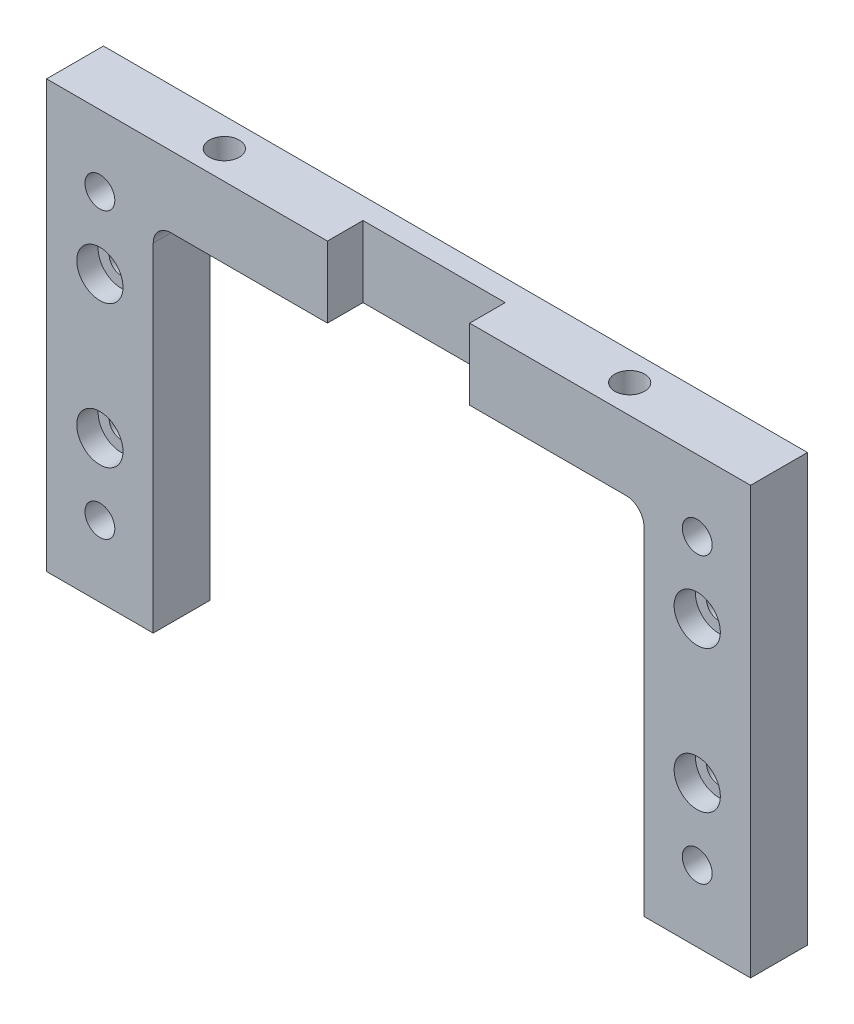
ISO-10303-21;
HEADER;
FILE_DESCRIPTION(('STEP AP214'),'2;1');
FILE_NAME('part.step','',(''),(''),'','','');
FILE_SCHEMA(('AUTOMOTIVE_DESIGN { 1 0 10303 214 1 1 1 1 }'));
ENDSEC;
DATA;
#1=APPLICATION_CONTEXT('core data for automotive mechanical design processes');
#2=APPLICATION_PROTOCOL_DEFINITION('international standard','automotive_design',2000,#1);
#3=PRODUCT_CONTEXT('',#1,'mechanical');
#4=PRODUCT('Part','Part','',(#3));
#5=PRODUCT_RELATED_PRODUCT_CATEGORY('part','',(#4));
#6=PRODUCT_DEFINITION_FORMATION('','',#4);
#7=PRODUCT_DEFINITION_CONTEXT('part definition',#1,'design');
#8=PRODUCT_DEFINITION('design','',#6,#7);
#9=PRODUCT_DEFINITION_SHAPE('','',#8);
#10=(LENGTH_UNIT() NAMED_UNIT(*) SI_UNIT(.MILLI.,.METRE.));
#11=(NAMED_UNIT(*) PLANE_ANGLE_UNIT() SI_UNIT($,.RADIAN.));
#12=(NAMED_UNIT(*) SI_UNIT($,.STERADIAN.) SOLID_ANGLE_UNIT());
#13=UNCERTAINTY_MEASURE_WITH_UNIT(LENGTH_MEASURE(1.E-05),#10,'distance_accuracy_value','');
#14=(GEOMETRIC_REPRESENTATION_CONTEXT(3) GLOBAL_UNCERTAINTY_ASSIGNED_CONTEXT((#13)) GLOBAL_UNIT_ASSIGNED_CONTEXT((#10,
#11,#12)) REPRESENTATION_CONTEXT('',''));
#15=CARTESIAN_POINT('',(0.,0.,0.));
#16=DIRECTION('',(0.,0.,1.));
#17=DIRECTION('',(1.,0.,0.));
#18=AXIS2_PLACEMENT_3D('',#15,#16,#17);
#19=CARTESIAN_POINT('',(32.,47.5,4.));
#20=DIRECTION('',(0.,0.,1.));
#21=DIRECTION('',(1.,0.,0.));
#22=AXIS2_PLACEMENT_3D('',#19,#20,#21);
#23=PLANE('',#22);
#24=DIRECTION('',(0.,-1.,0.));
#25=VECTOR('',#24,1.);
#26=CARTESIAN_POINT('',(-10.,50.,4.));
#27=LINE('',#26,#25);
#28=CARTESIAN_POINT('',(-10.,60.,4.));
#29=VERTEX_POINT('',#28);
#30=CARTESIAN_POINT('',(-10.,50.,4.));
#31=VERTEX_POINT('',#30);
#32=EDGE_CURVE('E141',#29,#31,#27,.T.);
#33=ORIENTED_EDGE('',*,*,#32,.F.);
#34=DIRECTION('',(-1.,0.,0.));
#35=VECTOR('',#34,1.);
#36=CARTESIAN_POINT('',(-49.5,60.,4.));
#37=LINE('',#36,#35);
#38=CARTESIAN_POINT('',(-49.5,60.,4.));
#39=VERTEX_POINT('',#38);
#40=EDGE_CURVE('E133',#29,#39,#37,.T.);
#41=ORIENTED_EDGE('',*,*,#40,.T.);
#42=DIRECTION('',(0.,-1.,0.));
#43=VECTOR('',#42,1.);
#44=CARTESIAN_POINT('',(-49.5,0.,4.));
#45=LINE('',#44,#43);
#46=CARTESIAN_POINT('',(-49.5,0.,4.));
#47=VERTEX_POINT('',#46);
#48=EDGE_CURVE('E137',#39,#47,#45,.T.);
#49=ORIENTED_EDGE('',*,*,#48,.T.);
#50=DIRECTION('',(1.,0.,0.));
#51=VECTOR('',#50,1.);
#52=CARTESIAN_POINT('',(-34.5,0.,4.));
#53=LINE('',#52,#51);
#54=CARTESIAN_POINT('',(-34.5,0.,4.));
#55=VERTEX_POINT('',#54);
#56=EDGE_CURVE('E63',#47,#55,#53,.T.);
#57=ORIENTED_EDGE('',*,*,#56,.T.);
#58=DIRECTION('',(0.,1.,0.));
#59=VECTOR('',#58,1.);
#60=CARTESIAN_POINT('',(-34.5,47.5,4.));
#61=LINE('',#60,#59);
#62=CARTESIAN_POINT('',(-34.5,47.5,4.));
#63=VERTEX_POINT('',#62);
#64=EDGE_CURVE('E186',#55,#63,#61,.T.);
#65=ORIENTED_EDGE('',*,*,#64,.T.);
#66=CARTESIAN_POINT('',(-32.,47.5,4.));
#67=DIRECTION('',(0.,0.,-1.));
#68=DIRECTION('',(1.,0.,0.));
#69=AXIS2_PLACEMENT_3D('',#66,#67,#68);
#70=CIRCLE('',#69,2.5);
#71=CARTESIAN_POINT('',(-32.,50.,4.));
#72=VERTEX_POINT('',#71);
#73=EDGE_CURVE('E110',#63,#72,#70,.T.);
#74=ORIENTED_EDGE('',*,*,#73,.T.);
#75=DIRECTION('',(1.,0.,0.));
#76=VECTOR('',#75,1.);
#77=CARTESIAN_POINT('',(32.,50.,4.));
#78=LINE('',#77,#76);
#79=EDGE_CURVE('E209',#72,#31,#78,.T.);
#80=ORIENTED_EDGE('',*,*,#79,.T.);
#81=EDGE_LOOP('',(#33,#41,#49,#57,#65,#74,#80));
#82=FACE_BOUND('',#81,.T.);
#83=CARTESIAN_POINT('',(-42.,20.,4.));
#84=DIRECTION('',(0.,0.,1.));
#85=DIRECTION('',(1.,0.,0.));
#86=AXIS2_PLACEMENT_3D('',#83,#84,#85);
#87=CIRCLE('',#86,3.25);
#88=CARTESIAN_POINT('',(-38.75,20.,4.));
#89=VERTEX_POINT('',#88);
#90=EDGE_CURVE('E333',#89,#89,#87,.T.);
#91=ORIENTED_EDGE('',*,*,#90,.F.);
#92=EDGE_LOOP('',(#91));
#93=FACE_BOUND('',#92,.T.);
#94=CARTESIAN_POINT('',(-42.,40.,4.));
#95=DIRECTION('',(0.,0.,1.));
#96=DIRECTION('',(1.,0.,0.));
#97=AXIS2_PLACEMENT_3D('',#94,#95,#96);
#98=CIRCLE('',#97,3.25);
#99=CARTESIAN_POINT('',(-38.75,40.,4.));
#100=VERTEX_POINT('',#99);
#101=EDGE_CURVE('E321',#100,#100,#98,.T.);
#102=ORIENTED_EDGE('',*,*,#101,.F.);
#103=EDGE_LOOP('',(#102));
#104=FACE_BOUND('',#103,.T.);
#105=CARTESIAN_POINT('',(-42.,50.,4.));
#106=DIRECTION('',(0.,0.,1.));
#107=DIRECTION('',(1.,0.,0.));
#108=AXIS2_PLACEMENT_3D('',#105,#106,#107);
#109=CIRCLE('',#108,2.1);
#110=CARTESIAN_POINT('',(-39.9,50.,4.));
#111=VERTEX_POINT('',#110);
#112=EDGE_CURVE('E315',#111,#111,#109,.T.);
#113=ORIENTED_EDGE('',*,*,#112,.F.);
#114=EDGE_LOOP('',(#113));
#115=FACE_BOUND('',#114,.T.);
#116=CARTESIAN_POINT('',(-42.,10.,4.));
#117=DIRECTION('',(0.,0.,1.));
#118=DIRECTION('',(1.,0.,0.));
#119=AXIS2_PLACEMENT_3D('',#116,#117,#118);
#120=CIRCLE('',#119,2.1);
#121=CARTESIAN_POINT('',(-39.9,10.,4.));
#122=VERTEX_POINT('',#121);
#123=EDGE_CURVE('E309',#122,#122,#120,.T.);
#124=ORIENTED_EDGE('',*,*,#123,.F.);
#125=EDGE_LOOP('',(#124));
#126=FACE_BOUND('',#125,.T.);
#127=ADVANCED_FACE('F39',(#82,#93,#104,#115,#126),#23,.T.);
#128=CARTESIAN_POINT('',(-49.5,60.,4.));
#129=DIRECTION('',(0.,-1.,0.));
#130=DIRECTION('',(0.,0.,-1.));
#131=AXIS2_PLACEMENT_3D('',#128,#129,#130);
#132=PLANE('',#131);
#133=ORIENTED_EDGE('',*,*,#40,.F.);
#134=DIRECTION('',(0.,0.,1.));
#135=VECTOR('',#134,1.);
#136=CARTESIAN_POINT('',(-10.,60.,-1.));
#137=LINE('',#136,#135);
#138=CARTESIAN_POINT('',(-10.,60.,-1.));
#139=VERTEX_POINT('',#138);
#140=EDGE_CURVE('E252',#139,#29,#137,.T.);
#141=ORIENTED_EDGE('',*,*,#140,.F.);
#142=DIRECTION('',(-1.,0.,0.));
#143=VECTOR('',#142,1.);
#144=CARTESIAN_POINT('',(-10.,60.,-1.));
#145=LINE('',#144,#143);
#146=CARTESIAN_POINT('',(10.,60.,-1.));
#147=VERTEX_POINT('',#146);
#148=EDGE_CURVE('E249',#147,#139,#145,.T.);
#149=ORIENTED_EDGE('',*,*,#148,.F.);
#150=DIRECTION('',(0.,0.,1.));
#151=VECTOR('',#150,1.);
#152=CARTESIAN_POINT('',(10.,60.,-1.));
#153=LINE('',#152,#151);
#154=CARTESIAN_POINT('',(10.,60.,4.));
#155=VERTEX_POINT('',#154);
#156=EDGE_CURVE('E246',#147,#155,#153,.T.);
#157=ORIENTED_EDGE('',*,*,#156,.T.);
#158=CARTESIAN_POINT('',(49.5,60.,4.));
#159=VERTEX_POINT('',#158);
#160=EDGE_CURVE('E144',#159,#155,#37,.T.);
#161=ORIENTED_EDGE('',*,*,#160,.F.);
#162=DIRECTION('',(0.,0.,-1.));
#163=VECTOR('',#162,1.);
#164=CARTESIAN_POINT('',(49.5,60.,4.));
#165=LINE('',#164,#163);
#166=CARTESIAN_POINT('',(49.5,60.,-4.));
#167=VERTEX_POINT('',#166);
#168=EDGE_CURVE('E156',#159,#167,#165,.T.);
#169=ORIENTED_EDGE('',*,*,#168,.T.);
#170=DIRECTION('',(-1.,0.,0.));
#171=VECTOR('',#170,1.);
#172=CARTESIAN_POINT('',(-49.5,60.,-4.));
#173=LINE('',#172,#171);
#174=CARTESIAN_POINT('',(-49.5,60.,-4.));
#175=VERTEX_POINT('',#174);
#176=EDGE_CURVE('E153',#167,#175,#173,.T.);
#177=ORIENTED_EDGE('',*,*,#176,.T.);
#178=DIRECTION('',(0.,0.,-1.));
#179=VECTOR('',#178,1.);
#180=CARTESIAN_POINT('',(-49.5,60.,4.));
#181=LINE('',#180,#179);
#182=EDGE_CURVE('E148',#39,#175,#181,.T.);
#183=ORIENTED_EDGE('',*,*,#182,.F.);
#184=EDGE_LOOP('',(#133,#141,#149,#157,#161,#169,#177,#183));
#185=FACE_BOUND('',#184,.T.);
#186=CARTESIAN_POINT('',(-28.5,60.,0.));
#187=DIRECTION('',(0.,1.,0.));
#188=DIRECTION('',(0.,0.,1.));
#189=AXIS2_PLACEMENT_3D('',#186,#187,#188);
#190=CIRCLE('',#189,2.09999999999999);
#191=CARTESIAN_POINT('',(-28.5,60.,2.09999999999999));
#192=VERTEX_POINT('',#191);
#193=EDGE_CURVE('E303',#192,#192,#190,.T.);
#194=ORIENTED_EDGE('',*,*,#193,.F.);
#195=EDGE_LOOP('',(#194));
#196=FACE_BOUND('',#195,.T.);
#197=CARTESIAN_POINT('',(28.5,60.,0.));
#198=DIRECTION('',(0.,1.,0.));
#199=DIRECTION('',(0.,0.,1.));
#200=AXIS2_PLACEMENT_3D('',#197,#198,#199);
#201=CIRCLE('',#200,2.09999999999999);
#202=CARTESIAN_POINT('',(28.5,60.,2.09999999999999));
#203=VERTEX_POINT('',#202);
#204=EDGE_CURVE('E255',#203,#203,#201,.T.);
#205=ORIENTED_EDGE('',*,*,#204,.F.);
#206=EDGE_LOOP('',(#205));
#207=FACE_BOUND('',#206,.T.);
#208=ADVANCED_FACE('F149',(#185,#196,#207),#132,.F.);
#209=CARTESIAN_POINT('',(-34.5,47.5,4.));
#210=DIRECTION('',(-1.,0.,0.));
#211=DIRECTION('',(0.,-1.,0.));
#212=AXIS2_PLACEMENT_3D('',#209,#210,#211);
#213=PLANE('',#212);
#214=DIRECTION('',(0.,1.,0.));
#215=VECTOR('',#214,1.);
#216=CARTESIAN_POINT('',(-34.5,47.5,-4.));
#217=LINE('',#216,#215);
#218=CARTESIAN_POINT('',(-34.5,0.,-4.));
#219=VERTEX_POINT('',#218);
#220=CARTESIAN_POINT('',(-34.5,47.5,-4.));
#221=VERTEX_POINT('',#220);
#222=EDGE_CURVE('E166',#219,#221,#217,.T.);
#223=ORIENTED_EDGE('',*,*,#222,.T.);
#224=DIRECTION('',(0.,0.,-1.));
#225=VECTOR('',#224,1.);
#226=CARTESIAN_POINT('',(-34.5,47.5,4.));
#227=LINE('',#226,#225);
#228=EDGE_CURVE('E11',#63,#221,#227,.T.);
#229=ORIENTED_EDGE('',*,*,#228,.F.);
#230=ORIENTED_EDGE('',*,*,#64,.F.);
#231=DIRECTION('',(0.,0.,-1.));
#232=VECTOR('',#231,1.);
#233=CARTESIAN_POINT('',(-34.5,0.,4.));
#234=LINE('',#233,#232);
#235=EDGE_CURVE('E161',#55,#219,#234,.T.);
#236=ORIENTED_EDGE('',*,*,#235,.T.);
#237=EDGE_LOOP('',(#223,#229,#230,#236));
#238=FACE_BOUND('',#237,.T.);
#239=ADVANCED_FACE('F41',(#238),#213,.F.);
#240=CARTESIAN_POINT('',(-32.,47.5,4.));
#241=DIRECTION('',(0.,0.,-1.));
#242=DIRECTION('',(-1.,0.,0.));
#243=AXIS2_PLACEMENT_3D('',#240,#241,#242);
#244=CYLINDRICAL_SURFACE('',#243,2.5);
#245=CARTESIAN_POINT('',(-32.,47.5,-4.));
#246=DIRECTION('',(0.,0.,-1.));
#247=DIRECTION('',(1.,0.,0.));
#248=AXIS2_PLACEMENT_3D('',#245,#246,#247);
#249=CIRCLE('',#248,2.5);
#250=CARTESIAN_POINT('',(-32.,50.,-4.));
#251=VERTEX_POINT('',#250);
#252=EDGE_CURVE('E169',#221,#251,#249,.T.);
#253=ORIENTED_EDGE('',*,*,#252,.T.);
#254=DIRECTION('',(0.,0.,-1.));
#255=VECTOR('',#254,1.);
#256=CARTESIAN_POINT('',(-32.,50.,4.));
#257=LINE('',#256,#255);
#258=EDGE_CURVE('E47',#72,#251,#257,.T.);
#259=ORIENTED_EDGE('',*,*,#258,.F.);
#260=ORIENTED_EDGE('',*,*,#73,.F.);
#261=ORIENTED_EDGE('',*,*,#228,.T.);
#262=EDGE_LOOP('',(#253,#259,#260,#261));
#263=FACE_BOUND('',#262,.T.);
#264=ADVANCED_FACE('F411',(#263),#244,.F.);
#265=CARTESIAN_POINT('',(32.,50.,4.));
#266=DIRECTION('',(0.,1.,0.));
#267=DIRECTION('',(0.,0.,1.));
#268=AXIS2_PLACEMENT_3D('',#265,#266,#267);
#269=PLANE('',#268);
#270=CARTESIAN_POINT('',(28.5,50.,0.));
#271=DIRECTION('',(0.,1.,0.));
#272=DIRECTION('',(0.,0.,1.));
#273=AXIS2_PLACEMENT_3D('',#270,#271,#272);
#274=CIRCLE('',#273,2.09999999999999);
#275=CARTESIAN_POINT('',(28.5,50.,2.09999999999999));
#276=VERTEX_POINT('',#275);
#277=EDGE_CURVE('E264',#276,#276,#274,.T.);
#278=ORIENTED_EDGE('',*,*,#277,.T.);
#279=EDGE_LOOP('',(#278));
#280=FACE_BOUND('',#279,.T.);
#281=CARTESIAN_POINT('',(-28.5,50.,0.));
#282=DIRECTION('',(0.,1.,0.));
#283=DIRECTION('',(0.,0.,1.));
#284=AXIS2_PLACEMENT_3D('',#281,#282,#283);
#285=CIRCLE('',#284,2.09999999999999);
#286=CARTESIAN_POINT('',(-28.5,50.,2.09999999999999));
#287=VERTEX_POINT('',#286);
#288=EDGE_CURVE('E306',#287,#287,#285,.T.);
#289=ORIENTED_EDGE('',*,*,#288,.T.);
#290=EDGE_LOOP('',(#289));
#291=FACE_BOUND('',#290,.T.);
#292=DIRECTION('',(1.,0.,0.));
#293=VECTOR('',#292,1.);
#294=CARTESIAN_POINT('',(-10.,50.,-1.));
#295=LINE('',#294,#293);
#296=CARTESIAN_POINT('',(-10.,50.,-1.));
#297=VERTEX_POINT('',#296);
#298=CARTESIAN_POINT('',(10.,50.,-1.));
#299=VERTEX_POINT('',#298);
#300=EDGE_CURVE('E351',#297,#299,#295,.T.);
#301=ORIENTED_EDGE('',*,*,#300,.F.);
#302=DIRECTION('',(0.,0.,1.));
#303=VECTOR('',#302,1.);
#304=CARTESIAN_POINT('',(-10.,50.,-1.));
#305=LINE('',#304,#303);
#306=EDGE_CURVE('E257',#297,#31,#305,.T.);
#307=ORIENTED_EDGE('',*,*,#306,.T.);
#308=ORIENTED_EDGE('',*,*,#79,.F.);
#309=ORIENTED_EDGE('',*,*,#258,.T.);
#310=DIRECTION('',(1.,0.,0.));
#311=VECTOR('',#310,1.);
#312=CARTESIAN_POINT('',(32.,50.,-4.));
#313=LINE('',#312,#311);
#314=CARTESIAN_POINT('',(32.,50.,-4.));
#315=VERTEX_POINT('',#314);
#316=EDGE_CURVE('E172',#251,#315,#313,.T.);
#317=ORIENTED_EDGE('',*,*,#316,.T.);
#318=DIRECTION('',(0.,0.,-1.));
#319=VECTOR('',#318,1.);
#320=CARTESIAN_POINT('',(32.,50.,4.));
#321=LINE('',#320,#319);
#322=CARTESIAN_POINT('',(32.,50.,4.));
#323=VERTEX_POINT('',#322);
#324=EDGE_CURVE('E199',#323,#315,#321,.T.);
#325=ORIENTED_EDGE('',*,*,#324,.F.);
#326=CARTESIAN_POINT('',(10.,50.,4.));
#327=VERTEX_POINT('',#326);
#328=EDGE_CURVE('E345',#327,#323,#78,.T.);
#329=ORIENTED_EDGE('',*,*,#328,.F.);
#330=DIRECTION('',(0.,0.,1.));
#331=VECTOR('',#330,1.);
#332=CARTESIAN_POINT('',(10.,50.,-1.));
#333=LINE('',#332,#331);
#334=EDGE_CURVE('E54',#299,#327,#333,.T.);
#335=ORIENTED_EDGE('',*,*,#334,.F.);
#336=EDGE_LOOP('',(#301,#307,#308,#309,#317,#325,#329,#335));
#337=FACE_BOUND('',#336,.T.);
#338=ADVANCED_FACE('F206',(#280,#291,#337),#269,.F.);
#339=CARTESIAN_POINT('',(32.,47.5,4.));
#340=DIRECTION('',(0.,0.,-1.));
#341=DIRECTION('',(-1.,0.,0.));
#342=AXIS2_PLACEMENT_3D('',#339,#340,#341);
#343=CYLINDRICAL_SURFACE('',#342,2.5);
#344=CARTESIAN_POINT('',(32.,47.5,-4.));
#345=DIRECTION('',(0.,0.,-1.));
#346=DIRECTION('',(1.,0.,0.));
#347=AXIS2_PLACEMENT_3D('',#344,#345,#346);
#348=CIRCLE('',#347,2.5);
#349=CARTESIAN_POINT('',(34.5,47.5,-4.));
#350=VERTEX_POINT('',#349);
#351=EDGE_CURVE('E174',#315,#350,#348,.T.);
#352=ORIENTED_EDGE('',*,*,#351,.T.);
#353=DIRECTION('',(0.,0.,-1.));
#354=VECTOR('',#353,1.);
#355=CARTESIAN_POINT('',(34.5,47.5,4.));
#356=LINE('',#355,#354);
#357=CARTESIAN_POINT('',(34.5,47.5,4.));
#358=VERTEX_POINT('',#357);
#359=EDGE_CURVE('E196',#358,#350,#356,.T.);
#360=ORIENTED_EDGE('',*,*,#359,.F.);
#361=CARTESIAN_POINT('',(32.,47.5,4.));
#362=DIRECTION('',(0.,0.,-1.));
#363=DIRECTION('',(1.,0.,0.));
#364=AXIS2_PLACEMENT_3D('',#361,#362,#363);
#365=CIRCLE('',#364,2.5);
#366=EDGE_CURVE('E228',#323,#358,#365,.T.);
#367=ORIENTED_EDGE('',*,*,#366,.F.);
#368=ORIENTED_EDGE('',*,*,#324,.T.);
#369=EDGE_LOOP('',(#352,#360,#367,#368));
#370=FACE_BOUND('',#369,.T.);
#371=ADVANCED_FACE('F218',(#370),#343,.F.);
#372=CARTESIAN_POINT('',(34.5,0.,4.));
#373=DIRECTION('',(1.,0.,0.));
#374=DIRECTION('',(0.,1.,0.));
#375=AXIS2_PLACEMENT_3D('',#372,#373,#374);
#376=PLANE('',#375);
#377=DIRECTION('',(0.,-1.,0.));
#378=VECTOR('',#377,1.);
#379=CARTESIAN_POINT('',(34.5,0.,-4.));
#380=LINE('',#379,#378);
#381=CARTESIAN_POINT('',(34.5,0.,-4.));
#382=VERTEX_POINT('',#381);
#383=EDGE_CURVE('E176',#350,#382,#380,.T.);
#384=ORIENTED_EDGE('',*,*,#383,.T.);
#385=DIRECTION('',(0.,0.,-1.));
#386=VECTOR('',#385,1.);
#387=CARTESIAN_POINT('',(34.5,0.,4.));
#388=LINE('',#387,#386);
#389=CARTESIAN_POINT('',(34.5,0.,4.));
#390=VERTEX_POINT('',#389);
#391=EDGE_CURVE('E193',#390,#382,#388,.T.);
#392=ORIENTED_EDGE('',*,*,#391,.F.);
#393=DIRECTION('',(0.,-1.,0.));
#394=VECTOR('',#393,1.);
#395=CARTESIAN_POINT('',(34.5,0.,4.));
#396=LINE('',#395,#394);
#397=EDGE_CURVE('E224',#358,#390,#396,.T.);
#398=ORIENTED_EDGE('',*,*,#397,.F.);
#399=ORIENTED_EDGE('',*,*,#359,.T.);
#400=EDGE_LOOP('',(#384,#392,#398,#399));
#401=FACE_BOUND('',#400,.T.);
#402=ADVANCED_FACE('F222',(#401),#376,.F.);
#403=CARTESIAN_POINT('',(49.5,0.,4.));
#404=DIRECTION('',(0.,1.,0.));
#405=DIRECTION('',(-1.,0.,0.));
#406=AXIS2_PLACEMENT_3D('',#403,#404,#405);
#407=PLANE('',#406);
#408=DIRECTION('',(1.,0.,0.));
#409=VECTOR('',#408,1.);
#410=CARTESIAN_POINT('',(49.5,0.,-4.));
#411=LINE('',#410,#409);
#412=CARTESIAN_POINT('',(49.5,0.,-4.));
#413=VERTEX_POINT('',#412);
#414=EDGE_CURVE('E178',#382,#413,#411,.T.);
#415=ORIENTED_EDGE('',*,*,#414,.T.);
#416=DIRECTION('',(0.,0.,-1.));
#417=VECTOR('',#416,1.);
#418=CARTESIAN_POINT('',(49.5,0.,4.));
#419=LINE('',#418,#417);
#420=CARTESIAN_POINT('',(49.5,0.,4.));
#421=VERTEX_POINT('',#420);
#422=EDGE_CURVE('E190',#421,#413,#419,.T.);
#423=ORIENTED_EDGE('',*,*,#422,.F.);
#424=DIRECTION('',(1.,0.,0.));
#425=VECTOR('',#424,1.);
#426=CARTESIAN_POINT('',(49.5,0.,4.));
#427=LINE('',#426,#425);
#428=EDGE_CURVE('E227',#390,#421,#427,.T.);
#429=ORIENTED_EDGE('',*,*,#428,.F.);
#430=ORIENTED_EDGE('',*,*,#391,.T.);
#431=EDGE_LOOP('',(#415,#423,#429,#430));
#432=FACE_BOUND('',#431,.T.);
#433=ADVANCED_FACE('F402',(#432),#407,.F.);
#434=CARTESIAN_POINT('',(49.5,60.,4.));
#435=DIRECTION('',(-1.,0.,0.));
#436=DIRECTION('',(0.,0.,1.));
#437=AXIS2_PLACEMENT_3D('',#434,#435,#436);
#438=PLANE('',#437);
#439=DIRECTION('',(0.,1.,0.));
#440=VECTOR('',#439,1.);
#441=CARTESIAN_POINT('',(49.5,60.,-4.));
#442=LINE('',#441,#440);
#443=EDGE_CURVE('E180',#413,#167,#442,.T.);
#444=ORIENTED_EDGE('',*,*,#443,.T.);
#445=ORIENTED_EDGE('',*,*,#168,.F.);
#446=DIRECTION('',(0.,1.,0.));
#447=VECTOR('',#446,1.);
#448=CARTESIAN_POINT('',(49.5,60.,4.));
#449=LINE('',#448,#447);
#450=EDGE_CURVE('E145',#421,#159,#449,.T.);
#451=ORIENTED_EDGE('',*,*,#450,.F.);
#452=ORIENTED_EDGE('',*,*,#422,.T.);
#453=EDGE_LOOP('',(#444,#445,#451,#452));
#454=FACE_BOUND('',#453,.T.);
#455=ADVANCED_FACE('F241',(#454),#438,.F.);
#456=CARTESIAN_POINT('',(-49.5,0.,4.));
#457=DIRECTION('',(1.,0.,0.));
#458=DIRECTION('',(0.,0.,-1.));
#459=AXIS2_PLACEMENT_3D('',#456,#457,#458);
#460=PLANE('',#459);
#461=DIRECTION('',(0.,-1.,0.));
#462=VECTOR('',#461,1.);
#463=CARTESIAN_POINT('',(-49.5,0.,-4.));
#464=LINE('',#463,#462);
#465=CARTESIAN_POINT('',(-49.5,0.,-4.));
#466=VERTEX_POINT('',#465);
#467=EDGE_CURVE('E183',#175,#466,#464,.T.);
#468=ORIENTED_EDGE('',*,*,#467,.T.);
#469=DIRECTION('',(0.,0.,-1.));
#470=VECTOR('',#469,1.);
#471=CARTESIAN_POINT('',(-49.5,0.,4.));
#472=LINE('',#471,#470);
#473=EDGE_CURVE('E157',#47,#466,#472,.T.);
#474=ORIENTED_EDGE('',*,*,#473,.F.);
#475=ORIENTED_EDGE('',*,*,#48,.F.);
#476=ORIENTED_EDGE('',*,*,#182,.T.);
#477=EDGE_LOOP('',(#468,#474,#475,#476));
#478=FACE_BOUND('',#477,.T.);
#479=ADVANCED_FACE('F159',(#478),#460,.F.);
#480=CARTESIAN_POINT('',(-34.5,0.,4.));
#481=DIRECTION('',(0.,1.,0.));
#482=DIRECTION('',(-1.,0.,0.));
#483=AXIS2_PLACEMENT_3D('',#480,#481,#482);
#484=PLANE('',#483);
#485=DIRECTION('',(1.,0.,0.));
#486=VECTOR('',#485,1.);
#487=CARTESIAN_POINT('',(-34.5,0.,-4.));
#488=LINE('',#487,#486);
#489=EDGE_CURVE('E102',#466,#219,#488,.T.);
#490=ORIENTED_EDGE('',*,*,#489,.T.);
#491=ORIENTED_EDGE('',*,*,#235,.F.);
#492=ORIENTED_EDGE('',*,*,#56,.F.);
#493=ORIENTED_EDGE('',*,*,#473,.T.);
#494=EDGE_LOOP('',(#490,#491,#492,#493));
#495=FACE_BOUND('',#494,.T.);
#496=ADVANCED_FACE('F387',(#495),#484,.F.);
#497=DIRECTION('',(0.,1.,0.));
#498=VECTOR('',#497,1.);
#499=CARTESIAN_POINT('',(10.,50.,4.));
#500=LINE('',#499,#498);
#501=EDGE_CURVE('E347',#327,#155,#500,.T.);
#502=ORIENTED_EDGE('',*,*,#501,.F.);
#503=ORIENTED_EDGE('',*,*,#328,.T.);
#504=ORIENTED_EDGE('',*,*,#366,.T.);
#505=ORIENTED_EDGE('',*,*,#397,.T.);
#506=ORIENTED_EDGE('',*,*,#428,.T.);
#507=ORIENTED_EDGE('',*,*,#450,.T.);
#508=ORIENTED_EDGE('',*,*,#160,.T.);
#509=EDGE_LOOP('',(#502,#503,#504,#505,#506,#507,#508));
#510=FACE_BOUND('',#509,.T.);
#511=CARTESIAN_POINT('',(42.,10.,4.));
#512=DIRECTION('',(0.,0.,1.));
#513=DIRECTION('',(1.,0.,0.));
#514=AXIS2_PLACEMENT_3D('',#511,#512,#513);
#515=CIRCLE('',#514,2.1);
#516=CARTESIAN_POINT('',(44.1,10.,4.));
#517=VERTEX_POINT('',#516);
#518=EDGE_CURVE('E267',#517,#517,#515,.T.);
#519=ORIENTED_EDGE('',*,*,#518,.F.);
#520=EDGE_LOOP('',(#519));
#521=FACE_BOUND('',#520,.T.);
#522=CARTESIAN_POINT('',(42.,50.,4.));
#523=DIRECTION('',(0.,0.,1.));
#524=DIRECTION('',(1.,0.,0.));
#525=AXIS2_PLACEMENT_3D('',#522,#523,#524);
#526=CIRCLE('',#525,2.1);
#527=CARTESIAN_POINT('',(44.1,50.,4.));
#528=VERTEX_POINT('',#527);
#529=EDGE_CURVE('E273',#528,#528,#526,.T.);
#530=ORIENTED_EDGE('',*,*,#529,.F.);
#531=EDGE_LOOP('',(#530));
#532=FACE_BOUND('',#531,.T.);
#533=CARTESIAN_POINT('',(42.,40.,4.));
#534=DIRECTION('',(0.,0.,1.));
#535=DIRECTION('',(1.,0.,0.));
#536=AXIS2_PLACEMENT_3D('',#533,#534,#535);
#537=CIRCLE('',#536,3.25);
#538=CARTESIAN_POINT('',(45.25,40.,4.));
#539=VERTEX_POINT('',#538);
#540=EDGE_CURVE('E279',#539,#539,#537,.T.);
#541=ORIENTED_EDGE('',*,*,#540,.F.);
#542=EDGE_LOOP('',(#541));
#543=FACE_BOUND('',#542,.T.);
#544=CARTESIAN_POINT('',(42.,20.,4.));
#545=DIRECTION('',(0.,0.,1.));
#546=DIRECTION('',(1.,0.,0.));
#547=AXIS2_PLACEMENT_3D('',#544,#545,#546);
#548=CIRCLE('',#547,3.25);
#549=CARTESIAN_POINT('',(45.25,20.,4.));
#550=VERTEX_POINT('',#549);
#551=EDGE_CURVE('E291',#550,#550,#548,.T.);
#552=ORIENTED_EDGE('',*,*,#551,.F.);
#553=EDGE_LOOP('',(#552));
#554=FACE_BOUND('',#553,.T.);
#555=ADVANCED_FACE('F235',(#510,#521,#532,#543,#554),#23,.T.);
#556=CARTESIAN_POINT('',(32.,47.5,-4.));
#557=DIRECTION('',(0.,0.,1.));
#558=DIRECTION('',(1.,0.,0.));
#559=AXIS2_PLACEMENT_3D('',#556,#557,#558);
#560=PLANE('',#559);
#561=CARTESIAN_POINT('',(42.,10.,-4.));
#562=DIRECTION('',(0.,0.,1.));
#563=DIRECTION('',(1.,0.,0.));
#564=AXIS2_PLACEMENT_3D('',#561,#562,#563);
#565=CIRCLE('',#564,2.1);
#566=CARTESIAN_POINT('',(44.1,10.,-4.));
#567=VERTEX_POINT('',#566);
#568=EDGE_CURVE('E270',#567,#567,#565,.T.);
#569=ORIENTED_EDGE('',*,*,#568,.T.);
#570=EDGE_LOOP('',(#569));
#571=FACE_BOUND('',#570,.T.);
#572=CARTESIAN_POINT('',(42.,50.,-4.));
#573=DIRECTION('',(0.,0.,1.));
#574=DIRECTION('',(1.,0.,0.));
#575=AXIS2_PLACEMENT_3D('',#572,#573,#574);
#576=CIRCLE('',#575,2.1);
#577=CARTESIAN_POINT('',(44.1,50.,-4.));
#578=VERTEX_POINT('',#577);
#579=EDGE_CURVE('E276',#578,#578,#576,.T.);
#580=ORIENTED_EDGE('',*,*,#579,.T.);
#581=EDGE_LOOP('',(#580));
#582=FACE_BOUND('',#581,.T.);
#583=CARTESIAN_POINT('',(42.,40.,-4.));
#584=DIRECTION('',(0.,0.,1.));
#585=DIRECTION('',(1.,0.,0.));
#586=AXIS2_PLACEMENT_3D('',#583,#584,#585);
#587=CIRCLE('',#586,1.7);
#588=CARTESIAN_POINT('',(43.7,40.,-4.));
#589=VERTEX_POINT('',#588);
#590=EDGE_CURVE('E288',#589,#589,#587,.T.);
#591=ORIENTED_EDGE('',*,*,#590,.T.);
#592=EDGE_LOOP('',(#591));
#593=FACE_BOUND('',#592,.T.);
#594=CARTESIAN_POINT('',(42.,20.,-4.));
#595=DIRECTION('',(0.,0.,1.));
#596=DIRECTION('',(1.,0.,0.));
#597=AXIS2_PLACEMENT_3D('',#594,#595,#596);
#598=CIRCLE('',#597,1.7);
#599=CARTESIAN_POINT('',(43.7,20.,-4.));
#600=VERTEX_POINT('',#599);
#601=EDGE_CURVE('E300',#600,#600,#598,.T.);
#602=ORIENTED_EDGE('',*,*,#601,.T.);
#603=EDGE_LOOP('',(#602));
#604=FACE_BOUND('',#603,.T.);
#605=CARTESIAN_POINT('',(-42.,10.,-4.));
#606=DIRECTION('',(0.,0.,1.));
#607=DIRECTION('',(1.,0.,0.));
#608=AXIS2_PLACEMENT_3D('',#605,#606,#607);
#609=CIRCLE('',#608,2.1);
#610=CARTESIAN_POINT('',(-39.9,10.,-4.));
#611=VERTEX_POINT('',#610);
#612=EDGE_CURVE('E312',#611,#611,#609,.T.);
#613=ORIENTED_EDGE('',*,*,#612,.T.);
#614=EDGE_LOOP('',(#613));
#615=FACE_BOUND('',#614,.T.);
#616=CARTESIAN_POINT('',(-42.,50.,-4.));
#617=DIRECTION('',(0.,0.,1.));
#618=DIRECTION('',(1.,0.,0.));
#619=AXIS2_PLACEMENT_3D('',#616,#617,#618);
#620=CIRCLE('',#619,2.1);
#621=CARTESIAN_POINT('',(-39.9,50.,-4.));
#622=VERTEX_POINT('',#621);
#623=EDGE_CURVE('E318',#622,#622,#620,.T.);
#624=ORIENTED_EDGE('',*,*,#623,.T.);
#625=EDGE_LOOP('',(#624));
#626=FACE_BOUND('',#625,.T.);
#627=CARTESIAN_POINT('',(-42.,40.,-4.));
#628=DIRECTION('',(0.,0.,1.));
#629=DIRECTION('',(1.,0.,0.));
#630=AXIS2_PLACEMENT_3D('',#627,#628,#629);
#631=CIRCLE('',#630,1.7);
#632=CARTESIAN_POINT('',(-40.3,40.,-4.));
#633=VERTEX_POINT('',#632);
#634=EDGE_CURVE('E330',#633,#633,#631,.T.);
#635=ORIENTED_EDGE('',*,*,#634,.T.);
#636=EDGE_LOOP('',(#635));
#637=FACE_BOUND('',#636,.T.);
#638=CARTESIAN_POINT('',(-42.,20.,-4.));
#639=DIRECTION('',(0.,0.,1.));
#640=DIRECTION('',(1.,0.,0.));
#641=AXIS2_PLACEMENT_3D('',#638,#639,#640);
#642=CIRCLE('',#641,1.7);
#643=CARTESIAN_POINT('',(-40.3,20.,-4.));
#644=VERTEX_POINT('',#643);
#645=EDGE_CURVE('E170',#644,#644,#642,.T.);
#646=ORIENTED_EDGE('',*,*,#645,.T.);
#647=EDGE_LOOP('',(#646));
#648=FACE_BOUND('',#647,.T.);
#649=ORIENTED_EDGE('',*,*,#222,.F.);
#650=ORIENTED_EDGE('',*,*,#489,.F.);
#651=ORIENTED_EDGE('',*,*,#467,.F.);
#652=ORIENTED_EDGE('',*,*,#176,.F.);
#653=ORIENTED_EDGE('',*,*,#443,.F.);
#654=ORIENTED_EDGE('',*,*,#414,.F.);
#655=ORIENTED_EDGE('',*,*,#383,.F.);
#656=ORIENTED_EDGE('',*,*,#351,.F.);
#657=ORIENTED_EDGE('',*,*,#316,.F.);
#658=ORIENTED_EDGE('',*,*,#252,.F.);
#659=EDGE_LOOP('',(#649,#650,#651,#652,#653,#654,#655,#656,#657,#658));
#660=FACE_BOUND('',#659,.T.);
#661=ADVANCED_FACE('F213',(#571,#582,#593,#604,#615,#626,#637,#648,#660),#560,.F.);
#662=CARTESIAN_POINT('',(-42.,20.,4.));
#663=DIRECTION('',(0.,0.,1.));
#664=DIRECTION('',(1.,0.,0.));
#665=AXIS2_PLACEMENT_3D('',#662,#663,#664);
#666=CYLINDRICAL_SURFACE('',#665,1.7);
#667=ORIENTED_EDGE('',*,*,#645,.F.);
#668=EDGE_LOOP('',(#667));
#669=FACE_BOUND('',#668,.T.);
#670=CARTESIAN_POINT('',(-42.,20.,1.));
#671=DIRECTION('',(0.,0.,1.));
#672=DIRECTION('',(1.,0.,0.));
#673=AXIS2_PLACEMENT_3D('',#670,#671,#672);
#674=CIRCLE('',#673,1.7);
#675=CARTESIAN_POINT('',(-40.3,20.,1.));
#676=VERTEX_POINT('',#675);
#677=EDGE_CURVE('E339',#676,#676,#674,.T.);
#678=ORIENTED_EDGE('',*,*,#677,.T.);
#679=EDGE_LOOP('',(#678));
#680=FACE_BOUND('',#679,.T.);
#681=ADVANCED_FACE('F392',(#669,#680),#666,.F.);
#682=CARTESIAN_POINT('',(-40.3,20.,1.));
#683=DIRECTION('',(0.,0.,-1.));
#684=DIRECTION('',(-1.,0.,0.));
#685=AXIS2_PLACEMENT_3D('',#682,#683,#684);
#686=PLANE('',#685);
#687=ORIENTED_EDGE('',*,*,#677,.F.);
#688=EDGE_LOOP('',(#687));
#689=FACE_BOUND('',#688,.T.);
#690=CARTESIAN_POINT('',(-42.,20.,1.));
#691=DIRECTION('',(0.,0.,1.));
#692=DIRECTION('',(1.,0.,0.));
#693=AXIS2_PLACEMENT_3D('',#690,#691,#692);
#694=CIRCLE('',#693,3.25);
#695=CARTESIAN_POINT('',(-38.75,20.,1.));
#696=VERTEX_POINT('',#695);
#697=EDGE_CURVE('E336',#696,#696,#694,.T.);
#698=ORIENTED_EDGE('',*,*,#697,.T.);
#699=EDGE_LOOP('',(#698));
#700=FACE_BOUND('',#699,.T.);
#701=ADVANCED_FACE('F602',(#689,#700),#686,.F.);
#702=CARTESIAN_POINT('',(-42.,20.,4.));
#703=DIRECTION('',(0.,0.,1.));
#704=DIRECTION('',(1.,0.,0.));
#705=AXIS2_PLACEMENT_3D('',#702,#703,#704);
#706=CYLINDRICAL_SURFACE('',#705,3.25);
#707=ORIENTED_EDGE('',*,*,#697,.F.);
#708=EDGE_LOOP('',(#707));
#709=FACE_BOUND('',#708,.T.);
#710=ORIENTED_EDGE('',*,*,#90,.T.);
#711=EDGE_LOOP('',(#710));
#712=FACE_BOUND('',#711,.T.);
#713=ADVANCED_FACE('F594',(#709,#712),#706,.F.);
#714=CARTESIAN_POINT('',(-42.,40.,4.));
#715=DIRECTION('',(0.,0.,1.));
#716=DIRECTION('',(1.,0.,0.));
#717=AXIS2_PLACEMENT_3D('',#714,#715,#716);
#718=CYLINDRICAL_SURFACE('',#717,1.7);
#719=ORIENTED_EDGE('',*,*,#634,.F.);
#720=EDGE_LOOP('',(#719));
#721=FACE_BOUND('',#720,.T.);
#722=CARTESIAN_POINT('',(-42.,40.,1.));
#723=DIRECTION('',(0.,0.,1.));
#724=DIRECTION('',(1.,0.,0.));
#725=AXIS2_PLACEMENT_3D('',#722,#723,#724);
#726=CIRCLE('',#725,1.7);
#727=CARTESIAN_POINT('',(-40.3,40.,1.));
#728=VERTEX_POINT('',#727);
#729=EDGE_CURVE('E327',#728,#728,#726,.T.);
#730=ORIENTED_EDGE('',*,*,#729,.T.);
#731=EDGE_LOOP('',(#730));
#732=FACE_BOUND('',#731,.T.);
#733=ADVANCED_FACE('F586',(#721,#732),#718,.F.);
#734=CARTESIAN_POINT('',(-40.3,40.,1.));
#735=DIRECTION('',(0.,0.,-1.));
#736=DIRECTION('',(-1.,0.,0.));
#737=AXIS2_PLACEMENT_3D('',#734,#735,#736);
#738=PLANE('',#737);
#739=ORIENTED_EDGE('',*,*,#729,.F.);
#740=EDGE_LOOP('',(#739));
#741=FACE_BOUND('',#740,.T.);
#742=CARTESIAN_POINT('',(-42.,40.,1.));
#743=DIRECTION('',(0.,0.,1.));
#744=DIRECTION('',(1.,0.,0.));
#745=AXIS2_PLACEMENT_3D('',#742,#743,#744);
#746=CIRCLE('',#745,3.25);
#747=CARTESIAN_POINT('',(-38.75,40.,1.));
#748=VERTEX_POINT('',#747);
#749=EDGE_CURVE('E324',#748,#748,#746,.T.);
#750=ORIENTED_EDGE('',*,*,#749,.T.);
#751=EDGE_LOOP('',(#750));
#752=FACE_BOUND('',#751,.T.);
#753=ADVANCED_FACE('F577',(#741,#752),#738,.F.);
#754=CARTESIAN_POINT('',(-42.,40.,4.));
#755=DIRECTION('',(0.,0.,1.));
#756=DIRECTION('',(1.,0.,0.));
#757=AXIS2_PLACEMENT_3D('',#754,#755,#756);
#758=CYLINDRICAL_SURFACE('',#757,3.25);
#759=ORIENTED_EDGE('',*,*,#749,.F.);
#760=EDGE_LOOP('',(#759));
#761=FACE_BOUND('',#760,.T.);
#762=ORIENTED_EDGE('',*,*,#101,.T.);
#763=EDGE_LOOP('',(#762));
#764=FACE_BOUND('',#763,.T.);
#765=ADVANCED_FACE('F569',(#761,#764),#758,.F.);
#766=CARTESIAN_POINT('',(-42.,50.,4.));
#767=DIRECTION('',(0.,0.,1.));
#768=DIRECTION('',(1.,0.,0.));
#769=AXIS2_PLACEMENT_3D('',#766,#767,#768);
#770=CYLINDRICAL_SURFACE('',#769,2.1);
#771=ORIENTED_EDGE('',*,*,#623,.F.);
#772=EDGE_LOOP('',(#771));
#773=FACE_BOUND('',#772,.T.);
#774=ORIENTED_EDGE('',*,*,#112,.T.);
#775=EDGE_LOOP('',(#774));
#776=FACE_BOUND('',#775,.T.);
#777=ADVANCED_FACE('F561',(#773,#776),#770,.F.);
#778=CARTESIAN_POINT('',(-42.,10.,4.));
#779=DIRECTION('',(0.,0.,1.));
#780=DIRECTION('',(1.,0.,0.));
#781=AXIS2_PLACEMENT_3D('',#778,#779,#780);
#782=CYLINDRICAL_SURFACE('',#781,2.1);
#783=ORIENTED_EDGE('',*,*,#612,.F.);
#784=EDGE_LOOP('',(#783));
#785=FACE_BOUND('',#784,.T.);
#786=ORIENTED_EDGE('',*,*,#123,.T.);
#787=EDGE_LOOP('',(#786));
#788=FACE_BOUND('',#787,.T.);
#789=ADVANCED_FACE('F552',(#785,#788),#782,.F.);
#790=CARTESIAN_POINT('',(-28.5,60.,0.));
#791=DIRECTION('',(0.,1.,0.));
#792=DIRECTION('',(0.,0.,1.));
#793=AXIS2_PLACEMENT_3D('',#790,#791,#792);
#794=CYLINDRICAL_SURFACE('',#793,2.09999999999999);
#795=ORIENTED_EDGE('',*,*,#193,.T.);
#796=EDGE_LOOP('',(#795));
#797=FACE_BOUND('',#796,.T.);
#798=ORIENTED_EDGE('',*,*,#288,.F.);
#799=EDGE_LOOP('',(#798));
#800=FACE_BOUND('',#799,.T.);
#801=ADVANCED_FACE('F543',(#797,#800),#794,.F.);
#802=CARTESIAN_POINT('',(42.,20.,4.));
#803=DIRECTION('',(0.,0.,1.));
#804=DIRECTION('',(1.,0.,0.));
#805=AXIS2_PLACEMENT_3D('',#802,#803,#804);
#806=CYLINDRICAL_SURFACE('',#805,1.7);
#807=ORIENTED_EDGE('',*,*,#601,.F.);
#808=EDGE_LOOP('',(#807));
#809=FACE_BOUND('',#808,.T.);
#810=CARTESIAN_POINT('',(42.,20.,1.));
#811=DIRECTION('',(0.,0.,1.));
#812=DIRECTION('',(1.,0.,0.));
#813=AXIS2_PLACEMENT_3D('',#810,#811,#812);
#814=CIRCLE('',#813,1.7);
#815=CARTESIAN_POINT('',(43.7,20.,1.));
#816=VERTEX_POINT('',#815);
#817=EDGE_CURVE('E297',#816,#816,#814,.T.);
#818=ORIENTED_EDGE('',*,*,#817,.T.);
#819=EDGE_LOOP('',(#818));
#820=FACE_BOUND('',#819,.T.);
#821=ADVANCED_FACE('F535',(#809,#820),#806,.F.);
#822=CARTESIAN_POINT('',(43.7,20.,1.));
#823=DIRECTION('',(0.,0.,-1.));
#824=DIRECTION('',(-1.,0.,0.));
#825=AXIS2_PLACEMENT_3D('',#822,#823,#824);
#826=PLANE('',#825);
#827=ORIENTED_EDGE('',*,*,#817,.F.);
#828=EDGE_LOOP('',(#827));
#829=FACE_BOUND('',#828,.T.);
#830=CARTESIAN_POINT('',(42.,20.,1.));
#831=DIRECTION('',(0.,0.,1.));
#832=DIRECTION('',(1.,0.,0.));
#833=AXIS2_PLACEMENT_3D('',#830,#831,#832);
#834=CIRCLE('',#833,3.25);
#835=CARTESIAN_POINT('',(45.25,20.,1.));
#836=VERTEX_POINT('',#835);
#837=EDGE_CURVE('E294',#836,#836,#834,.T.);
#838=ORIENTED_EDGE('',*,*,#837,.T.);
#839=EDGE_LOOP('',(#838));
#840=FACE_BOUND('',#839,.T.);
#841=ADVANCED_FACE('F527',(#829,#840),#826,.F.);
#842=CARTESIAN_POINT('',(42.,20.,4.));
#843=DIRECTION('',(0.,0.,1.));
#844=DIRECTION('',(1.,0.,0.));
#845=AXIS2_PLACEMENT_3D('',#842,#843,#844);
#846=CYLINDRICAL_SURFACE('',#845,3.25);
#847=ORIENTED_EDGE('',*,*,#837,.F.);
#848=EDGE_LOOP('',(#847));
#849=FACE_BOUND('',#848,.T.);
#850=ORIENTED_EDGE('',*,*,#551,.T.);
#851=EDGE_LOOP('',(#850));
#852=FACE_BOUND('',#851,.T.);
#853=ADVANCED_FACE('F519',(#849,#852),#846,.F.);
#854=CARTESIAN_POINT('',(42.,40.,4.));
#855=DIRECTION('',(0.,0.,1.));
#856=DIRECTION('',(1.,0.,0.));
#857=AXIS2_PLACEMENT_3D('',#854,#855,#856);
#858=CYLINDRICAL_SURFACE('',#857,1.7);
#859=ORIENTED_EDGE('',*,*,#590,.F.);
#860=EDGE_LOOP('',(#859));
#861=FACE_BOUND('',#860,.T.);
#862=CARTESIAN_POINT('',(42.,40.,1.));
#863=DIRECTION('',(0.,0.,1.));
#864=DIRECTION('',(1.,0.,0.));
#865=AXIS2_PLACEMENT_3D('',#862,#863,#864);
#866=CIRCLE('',#865,1.7);
#867=CARTESIAN_POINT('',(43.7,40.,1.));
#868=VERTEX_POINT('',#867);
#869=EDGE_CURVE('E285',#868,#868,#866,.T.);
#870=ORIENTED_EDGE('',*,*,#869,.T.);
#871=EDGE_LOOP('',(#870));
#872=FACE_BOUND('',#871,.T.);
#873=ADVANCED_FACE('F511',(#861,#872),#858,.F.);
#874=CARTESIAN_POINT('',(43.7,40.,1.));
#875=DIRECTION('',(0.,0.,-1.));
#876=DIRECTION('',(-1.,0.,0.));
#877=AXIS2_PLACEMENT_3D('',#874,#875,#876);
#878=PLANE('',#877);
#879=ORIENTED_EDGE('',*,*,#869,.F.);
#880=EDGE_LOOP('',(#879));
#881=FACE_BOUND('',#880,.T.);
#882=CARTESIAN_POINT('',(42.,40.,1.));
#883=DIRECTION('',(0.,0.,1.));
#884=DIRECTION('',(1.,0.,0.));
#885=AXIS2_PLACEMENT_3D('',#882,#883,#884);
#886=CIRCLE('',#885,3.25);
#887=CARTESIAN_POINT('',(45.25,40.,1.));
#888=VERTEX_POINT('',#887);
#889=EDGE_CURVE('E282',#888,#888,#886,.T.);
#890=ORIENTED_EDGE('',*,*,#889,.T.);
#891=EDGE_LOOP('',(#890));
#892=FACE_BOUND('',#891,.T.);
#893=ADVANCED_FACE('F502',(#881,#892),#878,.F.);
#894=CARTESIAN_POINT('',(42.,40.,4.));
#895=DIRECTION('',(0.,0.,1.));
#896=DIRECTION('',(1.,0.,0.));
#897=AXIS2_PLACEMENT_3D('',#894,#895,#896);
#898=CYLINDRICAL_SURFACE('',#897,3.25);
#899=ORIENTED_EDGE('',*,*,#889,.F.);
#900=EDGE_LOOP('',(#899));
#901=FACE_BOUND('',#900,.T.);
#902=ORIENTED_EDGE('',*,*,#540,.T.);
#903=EDGE_LOOP('',(#902));
#904=FACE_BOUND('',#903,.T.);
#905=ADVANCED_FACE('F493',(#901,#904),#898,.F.);
#906=CARTESIAN_POINT('',(42.,50.,4.));
#907=DIRECTION('',(0.,0.,1.));
#908=DIRECTION('',(1.,0.,0.));
#909=AXIS2_PLACEMENT_3D('',#906,#907,#908);
#910=CYLINDRICAL_SURFACE('',#909,2.1);
#911=ORIENTED_EDGE('',*,*,#579,.F.);
#912=EDGE_LOOP('',(#911));
#913=FACE_BOUND('',#912,.T.);
#914=ORIENTED_EDGE('',*,*,#529,.T.);
#915=EDGE_LOOP('',(#914));
#916=FACE_BOUND('',#915,.T.);
#917=ADVANCED_FACE('F485',(#913,#916),#910,.F.);
#918=CARTESIAN_POINT('',(42.,10.,4.));
#919=DIRECTION('',(0.,0.,1.));
#920=DIRECTION('',(1.,0.,0.));
#921=AXIS2_PLACEMENT_3D('',#918,#919,#920);
#922=CYLINDRICAL_SURFACE('',#921,2.1);
#923=ORIENTED_EDGE('',*,*,#568,.F.);
#924=EDGE_LOOP('',(#923));
#925=FACE_BOUND('',#924,.T.);
#926=ORIENTED_EDGE('',*,*,#518,.T.);
#927=EDGE_LOOP('',(#926));
#928=FACE_BOUND('',#927,.T.);
#929=ADVANCED_FACE('F477',(#925,#928),#922,.F.);
#930=CARTESIAN_POINT('',(28.5,60.,0.));
#931=DIRECTION('',(0.,1.,0.));
#932=DIRECTION('',(0.,0.,1.));
#933=AXIS2_PLACEMENT_3D('',#930,#931,#932);
#934=CYLINDRICAL_SURFACE('',#933,2.09999999999999);
#935=ORIENTED_EDGE('',*,*,#204,.T.);
#936=EDGE_LOOP('',(#935));
#937=FACE_BOUND('',#936,.T.);
#938=ORIENTED_EDGE('',*,*,#277,.F.);
#939=EDGE_LOOP('',(#938));
#940=FACE_BOUND('',#939,.T.);
#941=ADVANCED_FACE('F459',(#937,#940),#934,.F.);
#942=CARTESIAN_POINT('',(-10.,50.,-1.));
#943=DIRECTION('',(-1.,0.,0.));
#944=DIRECTION('',(0.,0.,1.));
#945=AXIS2_PLACEMENT_3D('',#942,#943,#944);
#946=PLANE('',#945);
#947=ORIENTED_EDGE('',*,*,#32,.T.);
#948=ORIENTED_EDGE('',*,*,#306,.F.);
#949=DIRECTION('',(0.,-1.,0.));
#950=VECTOR('',#949,1.);
#951=CARTESIAN_POINT('',(-10.,50.,-1.));
#952=LINE('',#951,#950);
#953=EDGE_CURVE('E364',#139,#297,#952,.T.);
#954=ORIENTED_EDGE('',*,*,#953,.F.);
#955=ORIENTED_EDGE('',*,*,#140,.T.);
#956=EDGE_LOOP('',(#947,#948,#954,#955));
#957=FACE_BOUND('',#956,.T.);
#958=ADVANCED_FACE('F361',(#957),#946,.F.);
#959=CARTESIAN_POINT('',(10.,50.,-1.));
#960=DIRECTION('',(1.,0.,0.));
#961=DIRECTION('',(0.,0.,-1.));
#962=AXIS2_PLACEMENT_3D('',#959,#960,#961);
#963=PLANE('',#962);
#964=ORIENTED_EDGE('',*,*,#501,.T.);
#965=ORIENTED_EDGE('',*,*,#156,.F.);
#966=DIRECTION('',(0.,1.,0.));
#967=VECTOR('',#966,1.);
#968=CARTESIAN_POINT('',(10.,50.,-1.));
#969=LINE('',#968,#967);
#970=EDGE_CURVE('E353',#299,#147,#969,.T.);
#971=ORIENTED_EDGE('',*,*,#970,.F.);
#972=ORIENTED_EDGE('',*,*,#334,.T.);
#973=EDGE_LOOP('',(#964,#965,#971,#972));
#974=FACE_BOUND('',#973,.T.);
#975=ADVANCED_FACE('F372',(#974),#963,.F.);
#976=CARTESIAN_POINT('',(0.,0.,-1.));
#977=DIRECTION('',(0.,0.,-1.));
#978=DIRECTION('',(-1.,0.,0.));
#979=AXIS2_PLACEMENT_3D('',#976,#977,#978);
#980=PLANE('',#979);
#981=ORIENTED_EDGE('',*,*,#953,.T.);
#982=ORIENTED_EDGE('',*,*,#300,.T.);
#983=ORIENTED_EDGE('',*,*,#970,.T.);
#984=ORIENTED_EDGE('',*,*,#148,.T.);
#985=EDGE_LOOP('',(#981,#982,#983,#984));
#986=FACE_BOUND('',#985,.T.);
#987=ADVANCED_FACE('F370',(#986),#980,.F.);
#988=CLOSED_SHELL('',(#127,#208,#239,#264,#338,#371,#402,#433,#455,#479,#496,#555,#661,#681,
#701,#713,#733,#753,#765,#777,#789,#801,#821,#841,#853,#873,#893,#905,#917,#929,#941,#958,#975,#987));
#989=MANIFOLD_SOLID_BREP('B2',#988);
#990=ADVANCED_BREP_SHAPE_REPRESENTATION('',(#18,#989),#14);
#991=SHAPE_DEFINITION_REPRESENTATION(#9,#990);
ENDSEC;
END-ISO-10303-21;
